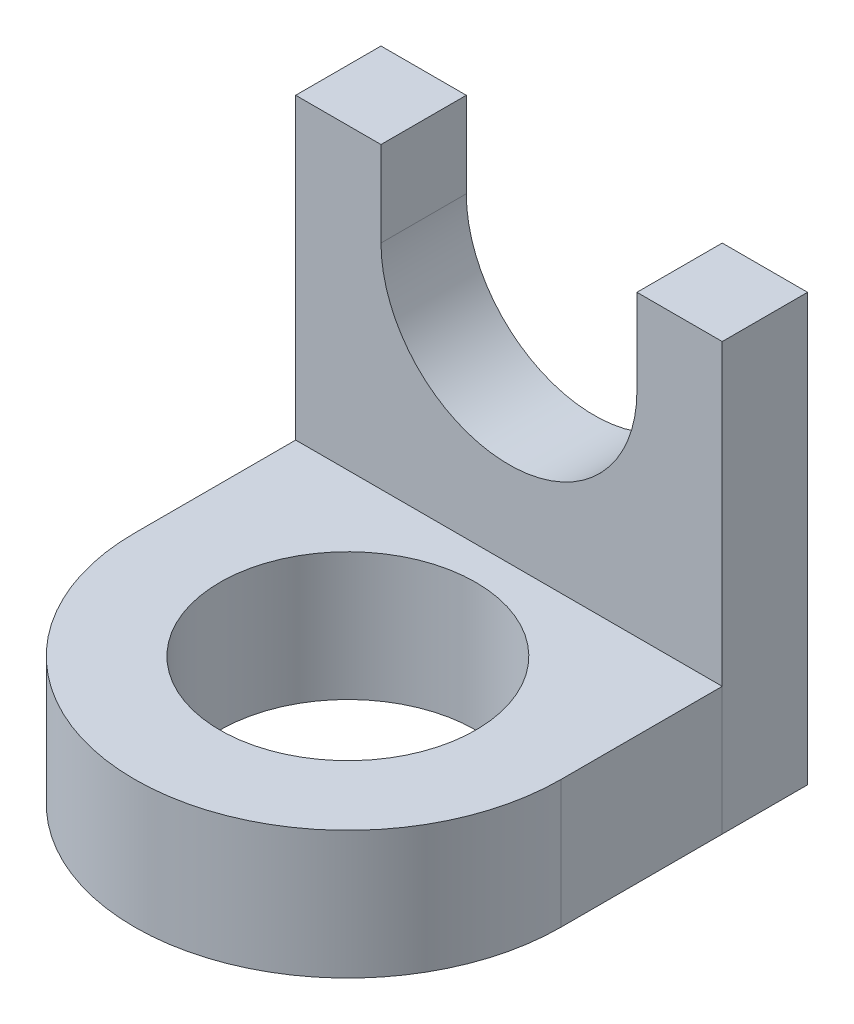
ISO-10303-21;
HEADER;
FILE_DESCRIPTION(('STEP AP214'),'2;1');
FILE_NAME('part.step','',(''),(''),'','','');
FILE_SCHEMA(('AUTOMOTIVE_DESIGN { 1 0 10303 214 1 1 1 1 }'));
ENDSEC;
DATA;
#1=APPLICATION_CONTEXT('core data for automotive mechanical design processes');
#2=APPLICATION_PROTOCOL_DEFINITION('international standard','automotive_design',2000,#1);
#3=PRODUCT_CONTEXT('',#1,'mechanical');
#4=PRODUCT('Part','Part','',(#3));
#5=PRODUCT_RELATED_PRODUCT_CATEGORY('part','',(#4));
#6=PRODUCT_DEFINITION_FORMATION('','',#4);
#7=PRODUCT_DEFINITION_CONTEXT('part definition',#1,'design');
#8=PRODUCT_DEFINITION('design','',#6,#7);
#9=PRODUCT_DEFINITION_SHAPE('','',#8);
#10=(LENGTH_UNIT() NAMED_UNIT(*) SI_UNIT(.MILLI.,.METRE.));
#11=(NAMED_UNIT(*) PLANE_ANGLE_UNIT() SI_UNIT($,.RADIAN.));
#12=(NAMED_UNIT(*) SI_UNIT($,.STERADIAN.) SOLID_ANGLE_UNIT());
#13=UNCERTAINTY_MEASURE_WITH_UNIT(LENGTH_MEASURE(1.E-05),#10,'distance_accuracy_value','');
#14=(GEOMETRIC_REPRESENTATION_CONTEXT(3) GLOBAL_UNCERTAINTY_ASSIGNED_CONTEXT((#13)) GLOBAL_UNIT_ASSIGNED_CONTEXT((#10,
#11,#12)) REPRESENTATION_CONTEXT('',''));
#15=CARTESIAN_POINT('',(0.,0.,0.));
#16=DIRECTION('',(0.,0.,1.));
#17=DIRECTION('',(1.,0.,0.));
#18=AXIS2_PLACEMENT_3D('',#15,#16,#17);
#19=CARTESIAN_POINT('',(-5.,-2.,2.));
#20=DIRECTION('',(-1.,0.,0.));
#21=DIRECTION('',(0.,0.,1.));
#22=AXIS2_PLACEMENT_3D('',#19,#20,#21);
#23=PLANE('',#22);
#24=DIRECTION('',(0.,0.,-1.));
#25=VECTOR('',#24,1.);
#26=CARTESIAN_POINT('',(-5.,-5.,2.));
#27=LINE('',#26,#25);
#28=CARTESIAN_POINT('',(-5.,-5.,5.77650514316614));
#29=VERTEX_POINT('',#28);
#30=CARTESIAN_POINT('',(-5.,-5.,2.));
#31=VERTEX_POINT('',#30);
#32=EDGE_CURVE('E108',#29,#31,#27,.T.);
#33=ORIENTED_EDGE('',*,*,#32,.F.);
#34=DIRECTION('',(0.,-1.,0.));
#35=VECTOR('',#34,1.);
#36=CARTESIAN_POINT('',(-5.,-2.,5.77650514316614));
#37=LINE('',#36,#35);
#38=CARTESIAN_POINT('',(-5.,-2.,5.77650514316614));
#39=VERTEX_POINT('',#38);
#40=EDGE_CURVE('E12',#39,#29,#37,.T.);
#41=ORIENTED_EDGE('',*,*,#40,.F.);
#42=DIRECTION('',(0.,0.,-1.));
#43=VECTOR('',#42,1.);
#44=CARTESIAN_POINT('',(-5.,-2.,2.));
#45=LINE('',#44,#43);
#46=CARTESIAN_POINT('',(-5.,-2.,2.));
#47=VERTEX_POINT('',#46);
#48=EDGE_CURVE('E101',#39,#47,#45,.T.);
#49=ORIENTED_EDGE('',*,*,#48,.T.);
#50=DIRECTION('',(0.,-1.,0.));
#51=VECTOR('',#50,1.);
#52=CARTESIAN_POINT('',(-5.,-2.,2.));
#53=LINE('',#52,#51);
#54=EDGE_CURVE('E46',#47,#31,#53,.T.);
#55=ORIENTED_EDGE('',*,*,#54,.T.);
#56=EDGE_LOOP('',(#33,#41,#49,#55));
#57=FACE_BOUND('',#56,.T.);
#58=ADVANCED_FACE('F43',(#57),#23,.T.);
#59=CARTESIAN_POINT('',(0.,-2.,5.77650514316614));
#60=DIRECTION('',(0.,-1.,0.));
#61=DIRECTION('',(0.,0.,-1.));
#62=AXIS2_PLACEMENT_3D('',#59,#60,#61);
#63=CYLINDRICAL_SURFACE('',#62,5.);
#64=CARTESIAN_POINT('',(0.,-5.,5.77650514316614));
#65=DIRECTION('',(0.,-1.,0.));
#66=DIRECTION('',(0.,0.,1.));
#67=AXIS2_PLACEMENT_3D('',#64,#65,#66);
#68=CIRCLE('',#67,5.);
#69=CARTESIAN_POINT('',(5.,-5.,5.77650514316614));
#70=VERTEX_POINT('',#69);
#71=EDGE_CURVE('E103',#70,#29,#68,.T.);
#72=ORIENTED_EDGE('',*,*,#71,.F.);
#73=DIRECTION('',(0.,-1.,0.));
#74=VECTOR('',#73,1.);
#75=CARTESIAN_POINT('',(5.,-2.,5.77650514316614));
#76=LINE('',#75,#74);
#77=CARTESIAN_POINT('',(5.,-2.,5.77650514316614));
#78=VERTEX_POINT('',#77);
#79=EDGE_CURVE('E52',#78,#70,#76,.T.);
#80=ORIENTED_EDGE('',*,*,#79,.F.);
#81=CARTESIAN_POINT('',(0.,-2.,5.77650514316614));
#82=DIRECTION('',(0.,-1.,0.));
#83=DIRECTION('',(0.,0.,1.));
#84=AXIS2_PLACEMENT_3D('',#81,#82,#83);
#85=CIRCLE('',#84,5.);
#86=EDGE_CURVE('E98',#78,#39,#85,.T.);
#87=ORIENTED_EDGE('',*,*,#86,.T.);
#88=ORIENTED_EDGE('',*,*,#40,.T.);
#89=EDGE_LOOP('',(#72,#80,#87,#88));
#90=FACE_BOUND('',#89,.T.);
#91=ADVANCED_FACE('F119',(#90),#63,.T.);
#92=CARTESIAN_POINT('',(5.,-2.,2.));
#93=DIRECTION('',(1.,0.,0.));
#94=DIRECTION('',(0.,0.,-1.));
#95=AXIS2_PLACEMENT_3D('',#92,#93,#94);
#96=PLANE('',#95);
#97=DIRECTION('',(0.,0.,1.));
#98=VECTOR('',#97,1.);
#99=CARTESIAN_POINT('',(5.,-5.,2.));
#100=LINE('',#99,#98);
#101=CARTESIAN_POINT('',(5.,-5.,2.));
#102=VERTEX_POINT('',#101);
#103=EDGE_CURVE('E93',#102,#70,#100,.T.);
#104=ORIENTED_EDGE('',*,*,#103,.F.);
#105=DIRECTION('',(0.,-1.,0.));
#106=VECTOR('',#105,1.);
#107=CARTESIAN_POINT('',(5.,-2.,2.));
#108=LINE('',#107,#106);
#109=CARTESIAN_POINT('',(5.,-2.,2.));
#110=VERTEX_POINT('',#109);
#111=EDGE_CURVE('E88',#110,#102,#108,.T.);
#112=ORIENTED_EDGE('',*,*,#111,.F.);
#113=DIRECTION('',(0.,0.,1.));
#114=VECTOR('',#113,1.);
#115=CARTESIAN_POINT('',(5.,-2.,2.));
#116=LINE('',#115,#114);
#117=EDGE_CURVE('E91',#110,#78,#116,.T.);
#118=ORIENTED_EDGE('',*,*,#117,.T.);
#119=ORIENTED_EDGE('',*,*,#79,.T.);
#120=EDGE_LOOP('',(#104,#112,#118,#119));
#121=FACE_BOUND('',#120,.T.);
#122=ADVANCED_FACE('F90',(#121),#96,.T.);
#123=CARTESIAN_POINT('',(-5.,-2.,2.));
#124=DIRECTION('',(0.,0.,-1.));
#125=DIRECTION('',(-1.,0.,0.));
#126=AXIS2_PLACEMENT_3D('',#123,#124,#125);
#127=PLANE('',#126);
#128=DIRECTION('',(1.,0.,0.));
#129=VECTOR('',#128,1.);
#130=CARTESIAN_POINT('',(-5.,-5.,2.));
#131=LINE('',#130,#129);
#132=EDGE_CURVE('E111',#31,#102,#131,.T.);
#133=ORIENTED_EDGE('',*,*,#132,.F.);
#134=ORIENTED_EDGE('',*,*,#54,.F.);
#135=DIRECTION('',(1.,0.,0.));
#136=VECTOR('',#135,1.);
#137=CARTESIAN_POINT('',(-5.,-2.,2.));
#138=LINE('',#137,#136);
#139=EDGE_CURVE('E97',#47,#110,#138,.T.);
#140=ORIENTED_EDGE('',*,*,#139,.T.);
#141=ORIENTED_EDGE('',*,*,#111,.T.);
#142=EDGE_LOOP('',(#133,#134,#140,#141));
#143=FACE_BOUND('',#142,.T.);
#144=ADVANCED_FACE('F100',(#143),#127,.T.);
#145=CARTESIAN_POINT('',(0.,-2.,5.77650514316614));
#146=DIRECTION('',(0.,1.,0.));
#147=DIRECTION('',(0.,0.,1.));
#148=AXIS2_PLACEMENT_3D('',#145,#146,#147);
#149=PLANE('',#148);
#150=CARTESIAN_POINT('',(0.,-2.,5.77650514316614));
#151=DIRECTION('',(0.,-1.,0.));
#152=DIRECTION('',(0.,0.,-1.));
#153=AXIS2_PLACEMENT_3D('',#150,#151,#152);
#154=CIRCLE('',#153,3.);
#155=CARTESIAN_POINT('',(0.,-2.,2.77650514316614));
#156=VERTEX_POINT('',#155);
#157=EDGE_CURVE('E112',#156,#156,#154,.T.);
#158=ORIENTED_EDGE('',*,*,#157,.T.);
#159=EDGE_LOOP('',(#158));
#160=FACE_BOUND('',#159,.T.);
#161=ORIENTED_EDGE('',*,*,#48,.F.);
#162=ORIENTED_EDGE('',*,*,#86,.F.);
#163=ORIENTED_EDGE('',*,*,#117,.F.);
#164=ORIENTED_EDGE('',*,*,#139,.F.);
#165=EDGE_LOOP('',(#161,#162,#163,#164));
#166=FACE_BOUND('',#165,.T.);
#167=ADVANCED_FACE('F96',(#160,#166),#149,.T.);
#168=CARTESIAN_POINT('',(0.,-5.,5.77650514316614));
#169=DIRECTION('',(0.,1.,0.));
#170=DIRECTION('',(0.,0.,1.));
#171=AXIS2_PLACEMENT_3D('',#168,#169,#170);
#172=PLANE('',#171);
#173=CARTESIAN_POINT('',(0.,-5.,5.77650514316614));
#174=DIRECTION('',(0.,-1.,0.));
#175=DIRECTION('',(0.,0.,-1.));
#176=AXIS2_PLACEMENT_3D('',#173,#174,#175);
#177=CIRCLE('',#176,3.);
#178=CARTESIAN_POINT('',(0.,-5.,2.77650514316614));
#179=VERTEX_POINT('',#178);
#180=EDGE_CURVE('E149',#179,#179,#177,.T.);
#181=ORIENTED_EDGE('',*,*,#180,.F.);
#182=EDGE_LOOP('',(#181));
#183=FACE_BOUND('',#182,.T.);
#184=ORIENTED_EDGE('',*,*,#32,.T.);
#185=ORIENTED_EDGE('',*,*,#132,.T.);
#186=ORIENTED_EDGE('',*,*,#103,.T.);
#187=ORIENTED_EDGE('',*,*,#71,.T.);
#188=EDGE_LOOP('',(#184,#185,#186,#187));
#189=FACE_BOUND('',#188,.T.);
#190=ADVANCED_FACE('F118',(#183,#189),#172,.F.);
#191=CARTESIAN_POINT('',(0.,-2.,5.77650514316614));
#192=DIRECTION('',(0.,-1.,0.));
#193=DIRECTION('',(0.,0.,-1.));
#194=AXIS2_PLACEMENT_3D('',#191,#192,#193);
#195=CYLINDRICAL_SURFACE('',#194,3.);
#196=ORIENTED_EDGE('',*,*,#157,.F.);
#197=EDGE_LOOP('',(#196));
#198=FACE_BOUND('',#197,.T.);
#199=ORIENTED_EDGE('',*,*,#180,.T.);
#200=EDGE_LOOP('',(#199));
#201=FACE_BOUND('',#200,.T.);
#202=ADVANCED_FACE('F137',(#198,#201),#195,.F.);
#203=CLOSED_SHELL('',(#58,#91,#122,#144,#167,#190,#202));
#204=MANIFOLD_SOLID_BREP('B2',#203);
#205=CARTESIAN_POINT('',(3.,5.,2.));
#206=DIRECTION('',(0.,-1.,0.));
#207=DIRECTION('',(0.,0.,-1.));
#208=AXIS2_PLACEMENT_3D('',#205,#206,#207);
#209=PLANE('',#208);
#210=DIRECTION('',(-1.,0.,0.));
#211=VECTOR('',#210,1.);
#212=CARTESIAN_POINT('',(3.,5.,0.));
#213=LINE('',#212,#211);
#214=CARTESIAN_POINT('',(5.,5.,0.));
#215=VERTEX_POINT('',#214);
#216=CARTESIAN_POINT('',(3.,5.,0.));
#217=VERTEX_POINT('',#216);
#218=EDGE_CURVE('E284',#215,#217,#213,.T.);
#219=ORIENTED_EDGE('',*,*,#218,.T.);
#220=DIRECTION('',(0.,0.,-1.));
#221=VECTOR('',#220,1.);
#222=CARTESIAN_POINT('',(3.,5.,2.));
#223=LINE('',#222,#221);
#224=CARTESIAN_POINT('',(3.,5.,2.));
#225=VERTEX_POINT('',#224);
#226=EDGE_CURVE('E41',#225,#217,#223,.T.);
#227=ORIENTED_EDGE('',*,*,#226,.F.);
#228=DIRECTION('',(-1.,0.,0.));
#229=VECTOR('',#228,1.);
#230=CARTESIAN_POINT('',(3.,5.,2.));
#231=LINE('',#230,#229);
#232=CARTESIAN_POINT('',(5.,5.,2.));
#233=VERTEX_POINT('',#232);
#234=EDGE_CURVE('E298',#233,#225,#231,.T.);
#235=ORIENTED_EDGE('',*,*,#234,.F.);
#236=DIRECTION('',(0.,0.,-1.));
#237=VECTOR('',#236,1.);
#238=CARTESIAN_POINT('',(5.,5.,2.));
#239=LINE('',#238,#237);
#240=EDGE_CURVE('E280',#233,#215,#239,.T.);
#241=ORIENTED_EDGE('',*,*,#240,.T.);
#242=EDGE_LOOP('',(#219,#227,#235,#241));
#243=FACE_BOUND('',#242,.T.);
#244=ADVANCED_FACE('F188',(#243),#209,.F.);
#245=CARTESIAN_POINT('',(3.,5.,2.));
#246=DIRECTION('',(1.,0.,0.));
#247=DIRECTION('',(0.,1.,0.));
#248=AXIS2_PLACEMENT_3D('',#245,#246,#247);
#249=PLANE('',#248);
#250=DIRECTION('',(0.,-1.,0.));
#251=VECTOR('',#250,1.);
#252=CARTESIAN_POINT('',(3.,5.,0.));
#253=LINE('',#252,#251);
#254=CARTESIAN_POINT('',(3.,3.,0.));
#255=VERTEX_POINT('',#254);
#256=EDGE_CURVE('E287',#217,#255,#253,.T.);
#257=ORIENTED_EDGE('',*,*,#256,.T.);
#258=DIRECTION('',(0.,0.,-1.));
#259=VECTOR('',#258,1.);
#260=CARTESIAN_POINT('',(3.,3.,2.));
#261=LINE('',#260,#259);
#262=CARTESIAN_POINT('',(3.,3.,2.));
#263=VERTEX_POINT('',#262);
#264=EDGE_CURVE('E196',#263,#255,#261,.T.);
#265=ORIENTED_EDGE('',*,*,#264,.F.);
#266=DIRECTION('',(0.,-1.,0.));
#267=VECTOR('',#266,1.);
#268=CARTESIAN_POINT('',(3.,5.,2.));
#269=LINE('',#268,#267);
#270=EDGE_CURVE('E247',#225,#263,#269,.T.);
#271=ORIENTED_EDGE('',*,*,#270,.F.);
#272=ORIENTED_EDGE('',*,*,#226,.T.);
#273=EDGE_LOOP('',(#257,#265,#271,#272));
#274=FACE_BOUND('',#273,.T.);
#275=ADVANCED_FACE('F333',(#274),#249,.F.);
#276=CARTESIAN_POINT('',(0.,3.,2.));
#277=DIRECTION('',(0.,0.,-1.));
#278=DIRECTION('',(-1.,0.,0.));
#279=AXIS2_PLACEMENT_3D('',#276,#277,#278);
#280=CYLINDRICAL_SURFACE('',#279,3.);
#281=CARTESIAN_POINT('',(0.,3.,0.));
#282=DIRECTION('',(0.,0.,-1.));
#283=DIRECTION('',(1.,0.,0.));
#284=AXIS2_PLACEMENT_3D('',#281,#282,#283);
#285=CIRCLE('',#284,3.);
#286=CARTESIAN_POINT('',(-3.,3.,0.));
#287=VERTEX_POINT('',#286);
#288=EDGE_CURVE('E289',#255,#287,#285,.T.);
#289=ORIENTED_EDGE('',*,*,#288,.T.);
#290=DIRECTION('',(0.,0.,-1.));
#291=VECTOR('',#290,1.);
#292=CARTESIAN_POINT('',(-3.,3.,2.));
#293=LINE('',#292,#291);
#294=CARTESIAN_POINT('',(-3.,3.,2.));
#295=VERTEX_POINT('',#294);
#296=EDGE_CURVE('E305',#295,#287,#293,.T.);
#297=ORIENTED_EDGE('',*,*,#296,.F.);
#298=CARTESIAN_POINT('',(0.,3.,2.));
#299=DIRECTION('',(0.,0.,-1.));
#300=DIRECTION('',(1.,0.,0.));
#301=AXIS2_PLACEMENT_3D('',#298,#299,#300);
#302=CIRCLE('',#301,3.);
#303=EDGE_CURVE('E313',#263,#295,#302,.T.);
#304=ORIENTED_EDGE('',*,*,#303,.F.);
#305=ORIENTED_EDGE('',*,*,#264,.T.);
#306=EDGE_LOOP('',(#289,#297,#304,#305));
#307=FACE_BOUND('',#306,.T.);
#308=ADVANCED_FACE('F311',(#307),#280,.F.);
#309=CARTESIAN_POINT('',(-3.,5.,2.));
#310=DIRECTION('',(-1.,0.,0.));
#311=DIRECTION('',(0.,0.,1.));
#312=AXIS2_PLACEMENT_3D('',#309,#310,#311);
#313=PLANE('',#312);
#314=DIRECTION('',(0.,1.,0.));
#315=VECTOR('',#314,1.);
#316=CARTESIAN_POINT('',(-3.,5.,0.));
#317=LINE('',#316,#315);
#318=CARTESIAN_POINT('',(-3.,5.,0.));
#319=VERTEX_POINT('',#318);
#320=EDGE_CURVE('E291',#287,#319,#317,.T.);
#321=ORIENTED_EDGE('',*,*,#320,.T.);
#322=DIRECTION('',(0.,0.,-1.));
#323=VECTOR('',#322,1.);
#324=CARTESIAN_POINT('',(-3.,5.,2.));
#325=LINE('',#324,#323);
#326=CARTESIAN_POINT('',(-3.,5.,2.));
#327=VERTEX_POINT('',#326);
#328=EDGE_CURVE('E302',#327,#319,#325,.T.);
#329=ORIENTED_EDGE('',*,*,#328,.F.);
#330=DIRECTION('',(0.,1.,0.));
#331=VECTOR('',#330,1.);
#332=CARTESIAN_POINT('',(-3.,5.,2.));
#333=LINE('',#332,#331);
#334=EDGE_CURVE('E325',#295,#327,#333,.T.);
#335=ORIENTED_EDGE('',*,*,#334,.F.);
#336=ORIENTED_EDGE('',*,*,#296,.T.);
#337=EDGE_LOOP('',(#321,#329,#335,#336));
#338=FACE_BOUND('',#337,.T.);
#339=ADVANCED_FACE('F321',(#338),#313,.F.);
#340=CARTESIAN_POINT('',(-5.,5.,2.));
#341=DIRECTION('',(0.,-1.,0.));
#342=DIRECTION('',(1.,0.,0.));
#343=AXIS2_PLACEMENT_3D('',#340,#341,#342);
#344=PLANE('',#343);
#345=DIRECTION('',(-1.,0.,0.));
#346=VECTOR('',#345,1.);
#347=CARTESIAN_POINT('',(-5.,5.,0.));
#348=LINE('',#347,#346);
#349=CARTESIAN_POINT('',(-5.,5.,0.));
#350=VERTEX_POINT('',#349);
#351=EDGE_CURVE('E293',#319,#350,#348,.T.);
#352=ORIENTED_EDGE('',*,*,#351,.T.);
#353=DIRECTION('',(0.,0.,-1.));
#354=VECTOR('',#353,1.);
#355=CARTESIAN_POINT('',(-5.,5.,2.));
#356=LINE('',#355,#354);
#357=CARTESIAN_POINT('',(-5.,5.,2.));
#358=VERTEX_POINT('',#357);
#359=EDGE_CURVE('E275',#358,#350,#356,.T.);
#360=ORIENTED_EDGE('',*,*,#359,.F.);
#361=DIRECTION('',(-1.,0.,0.));
#362=VECTOR('',#361,1.);
#363=CARTESIAN_POINT('',(-5.,5.,2.));
#364=LINE('',#363,#362);
#365=EDGE_CURVE('E266',#327,#358,#364,.T.);
#366=ORIENTED_EDGE('',*,*,#365,.F.);
#367=ORIENTED_EDGE('',*,*,#328,.T.);
#368=EDGE_LOOP('',(#352,#360,#366,#367));
#369=FACE_BOUND('',#368,.T.);
#370=ADVANCED_FACE('F324',(#369),#344,.F.);
#371=CARTESIAN_POINT('',(-5.,-5.,2.));
#372=DIRECTION('',(1.,0.,0.));
#373=DIRECTION('',(0.,0.,-1.));
#374=AXIS2_PLACEMENT_3D('',#371,#372,#373);
#375=PLANE('',#374);
#376=DIRECTION('',(0.,-1.,0.));
#377=VECTOR('',#376,1.);
#378=CARTESIAN_POINT('',(-5.,-5.,0.));
#379=LINE('',#378,#377);
#380=CARTESIAN_POINT('',(-5.,-5.,0.));
#381=VERTEX_POINT('',#380);
#382=EDGE_CURVE('E274',#350,#381,#379,.T.);
#383=ORIENTED_EDGE('',*,*,#382,.T.);
#384=DIRECTION('',(0.,0.,-1.));
#385=VECTOR('',#384,1.);
#386=CARTESIAN_POINT('',(-5.,-5.,2.));
#387=LINE('',#386,#385);
#388=CARTESIAN_POINT('',(-5.,-5.,2.));
#389=VERTEX_POINT('',#388);
#390=EDGE_CURVE('E271',#389,#381,#387,.T.);
#391=ORIENTED_EDGE('',*,*,#390,.F.);
#392=DIRECTION('',(0.,-1.,0.));
#393=VECTOR('',#392,1.);
#394=CARTESIAN_POINT('',(-5.,-5.,2.));
#395=LINE('',#394,#393);
#396=EDGE_CURVE('E260',#358,#389,#395,.T.);
#397=ORIENTED_EDGE('',*,*,#396,.F.);
#398=ORIENTED_EDGE('',*,*,#359,.T.);
#399=EDGE_LOOP('',(#383,#391,#397,#398));
#400=FACE_BOUND('',#399,.T.);
#401=ADVANCED_FACE('F272',(#400),#375,.F.);
#402=CARTESIAN_POINT('',(-5.,-5.,2.));
#403=DIRECTION('',(0.,1.,0.));
#404=DIRECTION('',(0.,0.,1.));
#405=AXIS2_PLACEMENT_3D('',#402,#403,#404);
#406=PLANE('',#405);
#407=DIRECTION('',(1.,0.,0.));
#408=VECTOR('',#407,1.);
#409=CARTESIAN_POINT('',(-5.,-5.,0.));
#410=LINE('',#409,#408);
#411=CARTESIAN_POINT('',(5.,-5.,0.));
#412=VERTEX_POINT('',#411);
#413=EDGE_CURVE('E233',#381,#412,#410,.T.);
#414=ORIENTED_EDGE('',*,*,#413,.T.);
#415=DIRECTION('',(0.,0.,-1.));
#416=VECTOR('',#415,1.);
#417=CARTESIAN_POINT('',(5.,-5.,2.));
#418=LINE('',#417,#416);
#419=CARTESIAN_POINT('',(5.,-5.,2.));
#420=VERTEX_POINT('',#419);
#421=EDGE_CURVE('E276',#420,#412,#418,.T.);
#422=ORIENTED_EDGE('',*,*,#421,.F.);
#423=DIRECTION('',(1.,0.,0.));
#424=VECTOR('',#423,1.);
#425=CARTESIAN_POINT('',(-5.,-5.,2.));
#426=LINE('',#425,#424);
#427=EDGE_CURVE('E264',#389,#420,#426,.T.);
#428=ORIENTED_EDGE('',*,*,#427,.F.);
#429=ORIENTED_EDGE('',*,*,#390,.T.);
#430=EDGE_LOOP('',(#414,#422,#428,#429));
#431=FACE_BOUND('',#430,.T.);
#432=ADVANCED_FACE('F278',(#431),#406,.F.);
#433=CARTESIAN_POINT('',(5.,-5.,2.));
#434=DIRECTION('',(-1.,0.,0.));
#435=DIRECTION('',(0.,0.,1.));
#436=AXIS2_PLACEMENT_3D('',#433,#434,#435);
#437=PLANE('',#436);
#438=DIRECTION('',(0.,1.,0.));
#439=VECTOR('',#438,1.);
#440=CARTESIAN_POINT('',(5.,-5.,0.));
#441=LINE('',#440,#439);
#442=EDGE_CURVE('E239',#412,#215,#441,.T.);
#443=ORIENTED_EDGE('',*,*,#442,.T.);
#444=ORIENTED_EDGE('',*,*,#240,.F.);
#445=DIRECTION('',(0.,1.,0.));
#446=VECTOR('',#445,1.);
#447=CARTESIAN_POINT('',(5.,-5.,2.));
#448=LINE('',#447,#446);
#449=EDGE_CURVE('E204',#420,#233,#448,.T.);
#450=ORIENTED_EDGE('',*,*,#449,.F.);
#451=ORIENTED_EDGE('',*,*,#421,.T.);
#452=EDGE_LOOP('',(#443,#444,#450,#451));
#453=FACE_BOUND('',#452,.T.);
#454=ADVANCED_FACE('F349',(#453),#437,.F.);
#455=CARTESIAN_POINT('',(0.,3.,2.));
#456=DIRECTION('',(0.,0.,1.));
#457=DIRECTION('',(1.,0.,0.));
#458=AXIS2_PLACEMENT_3D('',#455,#456,#457);
#459=PLANE('',#458);
#460=ORIENTED_EDGE('',*,*,#234,.T.);
#461=ORIENTED_EDGE('',*,*,#270,.T.);
#462=ORIENTED_EDGE('',*,*,#303,.T.);
#463=ORIENTED_EDGE('',*,*,#334,.T.);
#464=ORIENTED_EDGE('',*,*,#365,.T.);
#465=ORIENTED_EDGE('',*,*,#396,.T.);
#466=ORIENTED_EDGE('',*,*,#427,.T.);
#467=ORIENTED_EDGE('',*,*,#449,.T.);
#468=EDGE_LOOP('',(#460,#461,#462,#463,#464,#465,#466,#467));
#469=FACE_BOUND('',#468,.T.);
#470=ADVANCED_FACE('F262',(#469),#459,.T.);
#471=CARTESIAN_POINT('',(0.,3.,0.));
#472=DIRECTION('',(0.,0.,1.));
#473=DIRECTION('',(1.,0.,0.));
#474=AXIS2_PLACEMENT_3D('',#471,#472,#473);
#475=PLANE('',#474);
#476=ORIENTED_EDGE('',*,*,#218,.F.);
#477=ORIENTED_EDGE('',*,*,#442,.F.);
#478=ORIENTED_EDGE('',*,*,#413,.F.);
#479=ORIENTED_EDGE('',*,*,#382,.F.);
#480=ORIENTED_EDGE('',*,*,#351,.F.);
#481=ORIENTED_EDGE('',*,*,#320,.F.);
#482=ORIENTED_EDGE('',*,*,#288,.F.);
#483=ORIENTED_EDGE('',*,*,#256,.F.);
#484=EDGE_LOOP('',(#476,#477,#478,#479,#480,#481,#482,#483));
#485=FACE_BOUND('',#484,.T.);
#486=ADVANCED_FACE('F317',(#485),#475,.F.);
#487=CLOSED_SHELL('',(#244,#275,#308,#339,#370,#401,#432,#454,#470,#486));
#488=MANIFOLD_SOLID_BREP('B6',#487);
#489=ADVANCED_BREP_SHAPE_REPRESENTATION('',(#18,#204,#488),#14);
#490=SHAPE_DEFINITION_REPRESENTATION(#9,#489);
ENDSEC;
END-ISO-10303-21;
